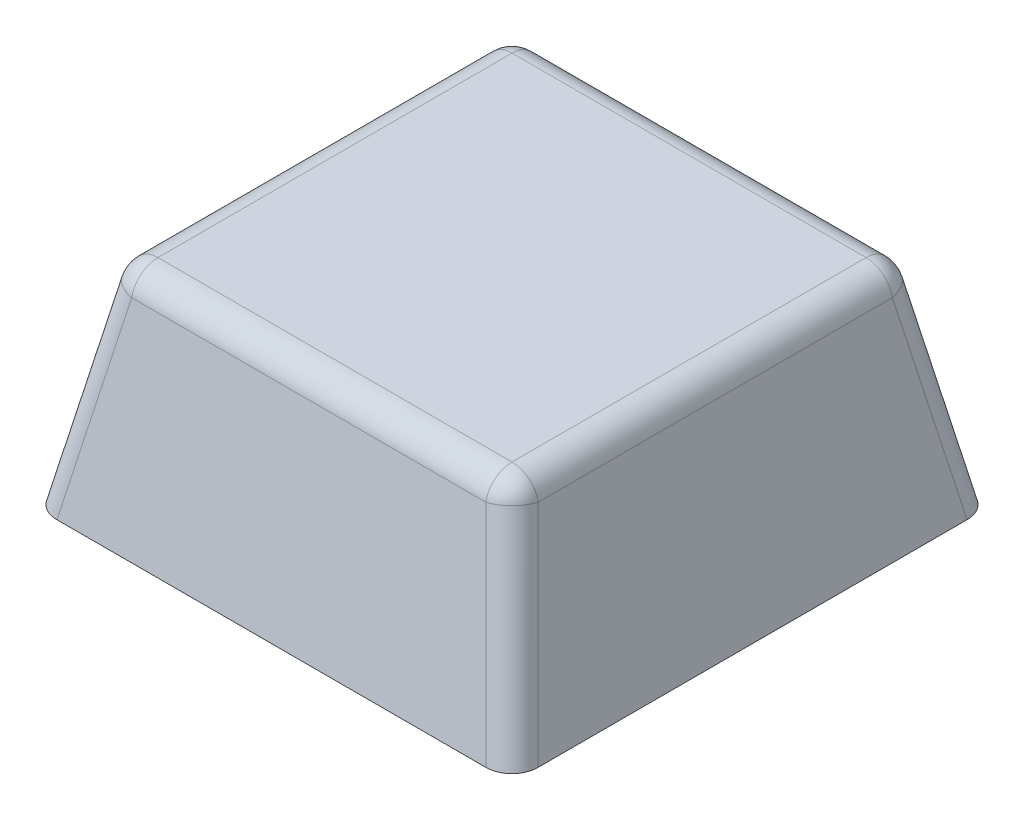
ISO-10303-21;
HEADER;
FILE_DESCRIPTION(('STEP AP214'),'2;1');
FILE_NAME('part.step','',(''),(''),'','','');
FILE_SCHEMA(('AUTOMOTIVE_DESIGN { 1 0 10303 214 1 1 1 1 }'));
ENDSEC;
DATA;
#1=APPLICATION_CONTEXT('core data for automotive mechanical design processes');
#2=APPLICATION_PROTOCOL_DEFINITION('international standard','automotive_design',2000,#1);
#3=PRODUCT_CONTEXT('',#1,'mechanical');
#4=PRODUCT('Part','Part','',(#3));
#5=PRODUCT_RELATED_PRODUCT_CATEGORY('part','',(#4));
#6=PRODUCT_DEFINITION_FORMATION('','',#4);
#7=PRODUCT_DEFINITION_CONTEXT('part definition',#1,'design');
#8=PRODUCT_DEFINITION('design','',#6,#7);
#9=PRODUCT_DEFINITION_SHAPE('','',#8);
#10=(LENGTH_UNIT() NAMED_UNIT(*) SI_UNIT(.MILLI.,.METRE.));
#11=(NAMED_UNIT(*) PLANE_ANGLE_UNIT() SI_UNIT($,.RADIAN.));
#12=(NAMED_UNIT(*) SI_UNIT($,.STERADIAN.) SOLID_ANGLE_UNIT());
#13=UNCERTAINTY_MEASURE_WITH_UNIT(LENGTH_MEASURE(1.E-05),#10,'distance_accuracy_value','');
#14=(GEOMETRIC_REPRESENTATION_CONTEXT(3) GLOBAL_UNCERTAINTY_ASSIGNED_CONTEXT((#13)) GLOBAL_UNIT_ASSIGNED_CONTEXT((#10,
#11,#12)) REPRESENTATION_CONTEXT('',''));
#15=CARTESIAN_POINT('',(0.,0.,0.));
#16=DIRECTION('',(0.,0.,1.));
#17=DIRECTION('',(1.,0.,0.));
#18=AXIS2_PLACEMENT_3D('',#15,#16,#17);
#19=CARTESIAN_POINT('',(0.,1.5,0.));
#20=DIRECTION('',(0.,-1.,0.));
#21=DIRECTION('',(0.,0.,-1.));
#22=AXIS2_PLACEMENT_3D('',#19,#20,#21);
#23=PLANE('',#22);
#24=CARTESIAN_POINT('',(0.,1.5,0.));
#25=DIRECTION('',(0.,-1.,0.));
#26=DIRECTION('',(0.,0.,-1.));
#27=AXIS2_PLACEMENT_3D('',#24,#25,#26);
#28=CIRCLE('',#27,2.8);
#29=CARTESIAN_POINT('',(0.,1.5,-2.8));
#30=VERTEX_POINT('',#29);
#31=EDGE_CURVE('E353',#30,#30,#28,.T.);
#32=ORIENTED_EDGE('',*,*,#31,.T.);
#33=EDGE_LOOP('',(#32));
#34=FACE_BOUND('',#33,.T.);
#35=DIRECTION('',(-1.,0.,0.));
#36=VECTOR('',#35,1.);
#37=CARTESIAN_POINT('',(0.,1.5,-0.580779620690919));
#38=LINE('',#37,#36);
#39=CARTESIAN_POINT('',(2.,1.5,-0.580779620690919));
#40=VERTEX_POINT('',#39);
#41=CARTESIAN_POINT('',(0.580779620690919,1.5,-0.580779620690919));
#42=VERTEX_POINT('',#41);
#43=EDGE_CURVE('E282',#40,#42,#38,.T.);
#44=ORIENTED_EDGE('',*,*,#43,.T.);
#45=DIRECTION('',(0.,0.,-1.));
#46=VECTOR('',#45,1.);
#47=CARTESIAN_POINT('',(0.580779620690918,1.5,0.));
#48=LINE('',#47,#46);
#49=CARTESIAN_POINT('',(0.580779620690919,1.5,-2.));
#50=VERTEX_POINT('',#49);
#51=EDGE_CURVE('E57',#42,#50,#48,.T.);
#52=ORIENTED_EDGE('',*,*,#51,.T.);
#53=DIRECTION('',(-1.,0.,0.));
#54=VECTOR('',#53,1.);
#55=CARTESIAN_POINT('',(0.,1.5,-2.));
#56=LINE('',#55,#54);
#57=CARTESIAN_POINT('',(-0.58077962069092,1.5,-2.));
#58=VERTEX_POINT('',#57);
#59=EDGE_CURVE('E240',#50,#58,#56,.T.);
#60=ORIENTED_EDGE('',*,*,#59,.T.);
#61=DIRECTION('',(0.,0.,-1.));
#62=VECTOR('',#61,1.);
#63=CARTESIAN_POINT('',(-0.58077962069092,1.5,0.));
#64=LINE('',#63,#62);
#65=CARTESIAN_POINT('',(-0.58077962069092,1.5,-0.580779620690919));
#66=VERTEX_POINT('',#65);
#67=EDGE_CURVE('E244',#66,#58,#64,.T.);
#68=ORIENTED_EDGE('',*,*,#67,.F.);
#69=DIRECTION('',(-1.,0.,0.));
#70=VECTOR('',#69,1.);
#71=CARTESIAN_POINT('',(0.,1.5,-0.580779620690919));
#72=LINE('',#71,#70);
#73=CARTESIAN_POINT('',(-2.,1.5,-0.580779620690919));
#74=VERTEX_POINT('',#73);
#75=EDGE_CURVE('E313',#66,#74,#72,.T.);
#76=ORIENTED_EDGE('',*,*,#75,.T.);
#77=DIRECTION('',(0.,0.,-1.));
#78=VECTOR('',#77,1.);
#79=CARTESIAN_POINT('',(-2.,1.5,0.));
#80=LINE('',#79,#78);
#81=CARTESIAN_POINT('',(-2.,1.5,0.580779620690919));
#82=VERTEX_POINT('',#81);
#83=EDGE_CURVE('E309',#82,#74,#80,.T.);
#84=ORIENTED_EDGE('',*,*,#83,.F.);
#85=DIRECTION('',(-1.,0.,0.));
#86=VECTOR('',#85,1.);
#87=CARTESIAN_POINT('',(0.,1.5,0.580779620690919));
#88=LINE('',#87,#86);
#89=CARTESIAN_POINT('',(-0.58077962069092,1.5,0.580779620690919));
#90=VERTEX_POINT('',#89);
#91=EDGE_CURVE('E305',#90,#82,#88,.T.);
#92=ORIENTED_EDGE('',*,*,#91,.F.);
#93=DIRECTION('',(0.,0.,-1.));
#94=VECTOR('',#93,1.);
#95=CARTESIAN_POINT('',(-0.58077962069092,1.5,0.));
#96=LINE('',#95,#94);
#97=CARTESIAN_POINT('',(-0.58077962069092,1.5,2.));
#98=VERTEX_POINT('',#97);
#99=EDGE_CURVE('E301',#98,#90,#96,.T.);
#100=ORIENTED_EDGE('',*,*,#99,.F.);
#101=DIRECTION('',(-1.,0.,0.));
#102=VECTOR('',#101,1.);
#103=CARTESIAN_POINT('',(0.,1.5,2.));
#104=LINE('',#103,#102);
#105=CARTESIAN_POINT('',(0.580779620690918,1.5,2.));
#106=VERTEX_POINT('',#105);
#107=EDGE_CURVE('E297',#106,#98,#104,.T.);
#108=ORIENTED_EDGE('',*,*,#107,.F.);
#109=DIRECTION('',(0.,0.,-1.));
#110=VECTOR('',#109,1.);
#111=CARTESIAN_POINT('',(0.580779620690918,1.5,0.));
#112=LINE('',#111,#110);
#113=CARTESIAN_POINT('',(0.580779620690919,1.5,0.580779620690919));
#114=VERTEX_POINT('',#113);
#115=EDGE_CURVE('E293',#106,#114,#112,.T.);
#116=ORIENTED_EDGE('',*,*,#115,.T.);
#117=DIRECTION('',(-1.,0.,0.));
#118=VECTOR('',#117,1.);
#119=CARTESIAN_POINT('',(0.,1.5,0.580779620690919));
#120=LINE('',#119,#118);
#121=CARTESIAN_POINT('',(2.,1.5,0.580779620690919));
#122=VERTEX_POINT('',#121);
#123=EDGE_CURVE('E289',#122,#114,#120,.T.);
#124=ORIENTED_EDGE('',*,*,#123,.F.);
#125=DIRECTION('',(0.,0.,-1.));
#126=VECTOR('',#125,1.);
#127=CARTESIAN_POINT('',(2.,1.5,0.));
#128=LINE('',#127,#126);
#129=EDGE_CURVE('E285',#122,#40,#128,.T.);
#130=ORIENTED_EDGE('',*,*,#129,.T.);
#131=EDGE_LOOP('',(#44,#52,#60,#68,#76,#84,#92,#100,#108,#116,#124,#130));
#132=FACE_BOUND('',#131,.T.);
#133=ADVANCED_FACE('F39',(#34,#132),#23,.T.);
#134=CARTESIAN_POINT('',(0.,0.,0.));
#135=DIRECTION('',(0.,-1.,0.));
#136=DIRECTION('',(0.,0.,-1.));
#137=AXIS2_PLACEMENT_3D('',#134,#135,#136);
#138=PLANE('',#137);
#139=DIRECTION('',(-1.,0.,0.));
#140=VECTOR('',#139,1.);
#141=CARTESIAN_POINT('',(-9.,0.,-9.));
#142=LINE('',#141,#140);
#143=CARTESIAN_POINT('',(8.01837281655234,0.,-9.));
#144=VERTEX_POINT('',#143);
#145=CARTESIAN_POINT('',(-8.01837281655234,0.,-9.));
#146=VERTEX_POINT('',#145);
#147=EDGE_CURVE('E407',#144,#146,#142,.T.);
#148=ORIENTED_EDGE('',*,*,#147,.F.);
#149=CARTESIAN_POINT('',(7.98128330504479,0.,-7.98128330504479));
#150=DIRECTION('',(0.,-1.,0.));
#151=DIRECTION('',(0.707106781186548,0.,-0.707106781186548));
#152=AXIS2_PLACEMENT_3D('',#149,#150,#151);
#153=ELLIPSE('',#152,1.03709566056413,1.);
#154=CARTESIAN_POINT('',(9.,0.,-8.01837281655234));
#155=VERTEX_POINT('',#154);
#156=EDGE_CURVE('E438',#144,#155,#153,.T.);
#157=ORIENTED_EDGE('',*,*,#156,.T.);
#158=DIRECTION('',(0.,0.,-1.));
#159=VECTOR('',#158,1.);
#160=CARTESIAN_POINT('',(9.,0.,9.));
#161=LINE('',#160,#159);
#162=CARTESIAN_POINT('',(9.,0.,8.01837281655234));
#163=VERTEX_POINT('',#162);
#164=EDGE_CURVE('E403',#163,#155,#161,.T.);
#165=ORIENTED_EDGE('',*,*,#164,.F.);
#166=CARTESIAN_POINT('',(7.98128330504479,0.,7.98128330504479));
#167=DIRECTION('',(0.,-1.,0.));
#168=DIRECTION('',(0.707106781186548,0.,0.707106781186548));
#169=AXIS2_PLACEMENT_3D('',#166,#167,#168);
#170=ELLIPSE('',#169,1.03709566056413,1.);
#171=CARTESIAN_POINT('',(8.01837281655234,0.,9.));
#172=VERTEX_POINT('',#171);
#173=EDGE_CURVE('E429',#163,#172,#170,.T.);
#174=ORIENTED_EDGE('',*,*,#173,.T.);
#175=DIRECTION('',(1.,0.,0.));
#176=VECTOR('',#175,1.);
#177=CARTESIAN_POINT('',(-9.,0.,9.));
#178=LINE('',#177,#176);
#179=CARTESIAN_POINT('',(-8.01837281655234,0.,9.));
#180=VERTEX_POINT('',#179);
#181=EDGE_CURVE('E415',#180,#172,#178,.T.);
#182=ORIENTED_EDGE('',*,*,#181,.F.);
#183=CARTESIAN_POINT('',(-7.98128330504479,0.,7.98128330504479));
#184=DIRECTION('',(0.,-1.,0.));
#185=DIRECTION('',(-0.707106781186548,0.,0.707106781186548));
#186=AXIS2_PLACEMENT_3D('',#183,#184,#185);
#187=ELLIPSE('',#186,1.03709566056413,1.);
#188=CARTESIAN_POINT('',(-9.,0.,8.01837281655234));
#189=VERTEX_POINT('',#188);
#190=EDGE_CURVE('E432',#180,#189,#187,.T.);
#191=ORIENTED_EDGE('',*,*,#190,.T.);
#192=DIRECTION('',(0.,0.,1.));
#193=VECTOR('',#192,1.);
#194=CARTESIAN_POINT('',(-9.,0.,9.));
#195=LINE('',#194,#193);
#196=CARTESIAN_POINT('',(-9.,0.,-8.01837281655234));
#197=VERTEX_POINT('',#196);
#198=EDGE_CURVE('E411',#197,#189,#195,.T.);
#199=ORIENTED_EDGE('',*,*,#198,.F.);
#200=CARTESIAN_POINT('',(-7.98128330504479,0.,-7.98128330504479));
#201=DIRECTION('',(0.,-1.,0.));
#202=DIRECTION('',(-0.707106781186548,0.,-0.707106781186548));
#203=AXIS2_PLACEMENT_3D('',#200,#201,#202);
#204=ELLIPSE('',#203,1.03709566056413,1.);
#205=EDGE_CURVE('E435',#197,#146,#204,.T.);
#206=ORIENTED_EDGE('',*,*,#205,.T.);
#207=EDGE_LOOP('',(#148,#157,#165,#174,#182,#191,#199,#206));
#208=FACE_BOUND('',#207,.T.);
#209=DIRECTION('',(0.,0.,1.));
#210=VECTOR('',#209,1.);
#211=CARTESIAN_POINT('',(7.98128330504478,0.,0.));
#212=LINE('',#211,#210);
#213=CARTESIAN_POINT('',(7.98128330504479,0.,7.98128330504479));
#214=VERTEX_POINT('',#213);
#215=CARTESIAN_POINT('',(7.98128330504479,0.,-7.98128330504479));
#216=VERTEX_POINT('',#215);
#217=EDGE_CURVE('E357',#214,#216,#212,.F.);
#218=ORIENTED_EDGE('',*,*,#217,.T.);
#219=DIRECTION('',(1.,0.,0.));
#220=VECTOR('',#219,1.);
#221=CARTESIAN_POINT('',(0.,0.,-7.98128330504478));
#222=LINE('',#221,#220);
#223=CARTESIAN_POINT('',(-7.98128330504479,0.,-7.98128330504479));
#224=VERTEX_POINT('',#223);
#225=EDGE_CURVE('E393',#216,#224,#222,.F.);
#226=ORIENTED_EDGE('',*,*,#225,.T.);
#227=DIRECTION('',(0.,0.,-1.));
#228=VECTOR('',#227,1.);
#229=CARTESIAN_POINT('',(-7.98128330504478,0.,0.));
#230=LINE('',#229,#228);
#231=CARTESIAN_POINT('',(-7.98128330504479,0.,7.98128330504479));
#232=VERTEX_POINT('',#231);
#233=EDGE_CURVE('E396',#224,#232,#230,.F.);
#234=ORIENTED_EDGE('',*,*,#233,.T.);
#235=DIRECTION('',(-1.,0.,0.));
#236=VECTOR('',#235,1.);
#237=CARTESIAN_POINT('',(0.,0.,7.98128330504478));
#238=LINE('',#237,#236);
#239=EDGE_CURVE('E65',#232,#214,#238,.F.);
#240=ORIENTED_EDGE('',*,*,#239,.T.);
#241=EDGE_LOOP('',(#218,#226,#234,#240));
#242=FACE_BOUND('',#241,.T.);
#243=ADVANCED_FACE('F537',(#208,#242),#138,.T.);
#244=CARTESIAN_POINT('',(9.,0.,9.));
#245=DIRECTION('',(0.981627183447664,0.190808995376545,0.));
#246=DIRECTION('',(-0.190808995376545,0.981627183447664,0.));
#247=AXIS2_PLACEMENT_3D('',#244,#245,#246);
#248=PLANE('',#247);
#249=ORIENTED_EDGE('',*,*,#164,.T.);
#250=DIRECTION('',(-0.187427559991896,0.964231206459825,0.187427559991896));
#251=VECTOR('',#250,1.);
#252=CARTESIAN_POINT('',(8.40216004551252,3.07561993876608,-7.42053286206486));
#253=LINE('',#252,#251);
#254=CARTESIAN_POINT('',(7.60224832452842,7.19080899537655,-6.62062114108076));
#255=VERTEX_POINT('',#254);
#256=EDGE_CURVE('E447',#155,#255,#253,.T.);
#257=ORIENTED_EDGE('',*,*,#256,.T.);
#258=DIRECTION('',(0.,0.,-1.));
#259=VECTOR('',#258,1.);
#260=CARTESIAN_POINT('',(7.60224832452842,7.19080899537655,9.));
#261=LINE('',#260,#259);
#262=CARTESIAN_POINT('',(7.60224832452842,7.19080899537655,6.62062114108076));
#263=VERTEX_POINT('',#262);
#264=EDGE_CURVE('E441',#255,#263,#261,.F.);
#265=ORIENTED_EDGE('',*,*,#264,.T.);
#266=DIRECTION('',(-0.187427559991896,0.964231206459825,-0.187427559991896));
#267=VECTOR('',#266,1.);
#268=CARTESIAN_POINT('',(9.0344836699138,-0.177403102540449,8.05285648646614));
#269=LINE('',#268,#267);
#270=EDGE_CURVE('E444',#263,#163,#269,.F.);
#271=ORIENTED_EDGE('',*,*,#270,.T.);
#272=EDGE_LOOP('',(#249,#257,#265,#271));
#273=FACE_BOUND('',#272,.T.);
#274=ADVANCED_FACE('F586',(#273),#248,.T.);
#275=CARTESIAN_POINT('',(-9.,0.,-9.));
#276=DIRECTION('',(0.,0.190808995376545,-0.981627183447664));
#277=DIRECTION('',(0.,0.981627183447664,0.190808995376545));
#278=AXIS2_PLACEMENT_3D('',#275,#276,#277);
#279=PLANE('',#278);
#280=DIRECTION('',(-1.,0.,0.));
#281=VECTOR('',#280,1.);
#282=CARTESIAN_POINT('',(-9.,7.19080899537655,-7.60224832452842));
#283=LINE('',#282,#281);
#284=CARTESIAN_POINT('',(-6.62062114108076,7.19080899537655,-7.60224832452842));
#285=VERTEX_POINT('',#284);
#286=CARTESIAN_POINT('',(6.62062114108076,7.19080899537655,-7.60224832452842));
#287=VERTEX_POINT('',#286);
#288=EDGE_CURVE('E419',#285,#287,#283,.F.);
#289=ORIENTED_EDGE('',*,*,#288,.T.);
#290=DIRECTION('',(-0.187427559991896,0.964231206459825,0.187427559991896));
#291=VECTOR('',#290,1.);
#292=CARTESIAN_POINT('',(7.42053286206486,3.07561993876608,-8.40216004551252));
#293=LINE('',#292,#291);
#294=EDGE_CURVE('E425',#287,#144,#293,.F.);
#295=ORIENTED_EDGE('',*,*,#294,.T.);
#296=ORIENTED_EDGE('',*,*,#147,.T.);
#297=DIRECTION('',(0.187427559991896,0.964231206459825,0.187427559991896));
#298=VECTOR('',#297,1.);
#299=CARTESIAN_POINT('',(-8.05285648646614,-0.177403102540449,-9.0344836699138));
#300=LINE('',#299,#298);
#301=EDGE_CURVE('E422',#146,#285,#300,.T.);
#302=ORIENTED_EDGE('',*,*,#301,.T.);
#303=EDGE_LOOP('',(#289,#295,#296,#302));
#304=FACE_BOUND('',#303,.T.);
#305=ADVANCED_FACE('F580',(#304),#279,.T.);
#306=CARTESIAN_POINT('',(-9.,0.,9.));
#307=DIRECTION('',(-0.981627183447664,0.190808995376545,0.));
#308=DIRECTION('',(-0.190808995376545,-0.981627183447664,0.));
#309=AXIS2_PLACEMENT_3D('',#306,#307,#308);
#310=PLANE('',#309);
#311=DIRECTION('',(0.,0.,1.));
#312=VECTOR('',#311,1.);
#313=CARTESIAN_POINT('',(-7.60224832452842,7.19080899537655,9.));
#314=LINE('',#313,#312);
#315=CARTESIAN_POINT('',(-7.60224832452842,7.19080899537655,6.62062114108076));
#316=VERTEX_POINT('',#315);
#317=CARTESIAN_POINT('',(-7.60224832452842,7.19080899537655,-6.62062114108076));
#318=VERTEX_POINT('',#317);
#319=EDGE_CURVE('E450',#316,#318,#314,.F.);
#320=ORIENTED_EDGE('',*,*,#319,.T.);
#321=DIRECTION('',(0.187427559991896,0.964231206459825,0.187427559991896));
#322=VECTOR('',#321,1.);
#323=CARTESIAN_POINT('',(-8.40216004551252,3.07561993876608,-7.42053286206486));
#324=LINE('',#323,#322);
#325=EDGE_CURVE('E456',#318,#197,#324,.F.);
#326=ORIENTED_EDGE('',*,*,#325,.T.);
#327=ORIENTED_EDGE('',*,*,#198,.T.);
#328=DIRECTION('',(0.187427559991896,0.964231206459825,-0.187427559991896));
#329=VECTOR('',#328,1.);
#330=CARTESIAN_POINT('',(-9.0344836699138,-0.177403102540449,8.05285648646614));
#331=LINE('',#330,#329);
#332=EDGE_CURVE('E453',#189,#316,#331,.T.);
#333=ORIENTED_EDGE('',*,*,#332,.T.);
#334=EDGE_LOOP('',(#320,#326,#327,#333));
#335=FACE_BOUND('',#334,.T.);
#336=ADVANCED_FACE('F574',(#335),#310,.T.);
#337=CARTESIAN_POINT('',(-9.,0.,9.));
#338=DIRECTION('',(0.,0.190808995376545,0.981627183447664));
#339=DIRECTION('',(0.,-0.981627183447664,0.190808995376545));
#340=AXIS2_PLACEMENT_3D('',#337,#338,#339);
#341=PLANE('',#340);
#342=DIRECTION('',(1.,0.,0.));
#343=VECTOR('',#342,1.);
#344=CARTESIAN_POINT('',(-9.,7.19080899537655,7.60224832452842));
#345=LINE('',#344,#343);
#346=CARTESIAN_POINT('',(6.62062114108076,7.19080899537655,7.60224832452842));
#347=VERTEX_POINT('',#346);
#348=CARTESIAN_POINT('',(-6.62062114108076,7.19080899537655,7.60224832452842));
#349=VERTEX_POINT('',#348);
#350=EDGE_CURVE('E459',#347,#349,#345,.F.);
#351=ORIENTED_EDGE('',*,*,#350,.T.);
#352=DIRECTION('',(0.187427559991896,0.964231206459825,-0.187427559991896));
#353=VECTOR('',#352,1.);
#354=CARTESIAN_POINT('',(-8.05285648646614,-0.177403102540449,9.0344836699138));
#355=LINE('',#354,#353);
#356=EDGE_CURVE('E465',#349,#180,#355,.F.);
#357=ORIENTED_EDGE('',*,*,#356,.T.);
#358=ORIENTED_EDGE('',*,*,#181,.T.);
#359=DIRECTION('',(-0.187427559991896,0.964231206459825,-0.187427559991896));
#360=VECTOR('',#359,1.);
#361=CARTESIAN_POINT('',(7.42053286206486,3.07561993876608,8.40216004551252));
#362=LINE('',#361,#360);
#363=EDGE_CURVE('E462',#172,#347,#362,.T.);
#364=ORIENTED_EDGE('',*,*,#363,.T.);
#365=EDGE_LOOP('',(#351,#357,#358,#364));
#366=FACE_BOUND('',#365,.T.);
#367=ADVANCED_FACE('F533',(#366),#341,.T.);
#368=CARTESIAN_POINT('',(0.,8.,0.));
#369=DIRECTION('',(0.,-1.,0.));
#370=DIRECTION('',(0.,0.,-1.));
#371=AXIS2_PLACEMENT_3D('',#368,#369,#370);
#372=PLANE('',#371);
#373=DIRECTION('',(0.,0.,1.));
#374=VECTOR('',#373,1.);
#375=CARTESIAN_POINT('',(6.62062114108075,8.,0.));
#376=LINE('',#375,#374);
#377=CARTESIAN_POINT('',(6.62062114108075,8.,6.62062114108075));
#378=VERTEX_POINT('',#377);
#379=CARTESIAN_POINT('',(6.62062114108075,8.,-6.62062114108075));
#380=VERTEX_POINT('',#379);
#381=EDGE_CURVE('E468',#378,#380,#376,.F.);
#382=ORIENTED_EDGE('',*,*,#381,.T.);
#383=DIRECTION('',(1.,0.,0.));
#384=VECTOR('',#383,1.);
#385=CARTESIAN_POINT('',(0.,8.,-6.62062114108075));
#386=LINE('',#385,#384);
#387=CARTESIAN_POINT('',(-6.62062114108075,8.,-6.62062114108075));
#388=VERTEX_POINT('',#387);
#389=EDGE_CURVE('E11',#380,#388,#386,.F.);
#390=ORIENTED_EDGE('',*,*,#389,.T.);
#391=DIRECTION('',(0.,0.,-1.));
#392=VECTOR('',#391,1.);
#393=CARTESIAN_POINT('',(-6.62062114108075,8.,0.));
#394=LINE('',#393,#392);
#395=CARTESIAN_POINT('',(-6.62062114108075,8.,6.62062114108075));
#396=VERTEX_POINT('',#395);
#397=EDGE_CURVE('E49',#388,#396,#394,.F.);
#398=ORIENTED_EDGE('',*,*,#397,.T.);
#399=DIRECTION('',(-1.,0.,0.));
#400=VECTOR('',#399,1.);
#401=CARTESIAN_POINT('',(0.,8.,6.62062114108075));
#402=LINE('',#401,#400);
#403=EDGE_CURVE('E471',#396,#378,#402,.F.);
#404=ORIENTED_EDGE('',*,*,#403,.T.);
#405=EDGE_LOOP('',(#382,#390,#398,#404));
#406=FACE_BOUND('',#405,.T.);
#407=ADVANCED_FACE('F558',(#406),#372,.F.);
#408=CARTESIAN_POINT('',(-8.05285648646614,-0.368212097916994,8.05285648646614));
#409=DIRECTION('',(-0.187427559991896,-0.964231206459825,0.187427559991896));
#410=DIRECTION('',(0.,-0.190808995376545,-0.981627183447664));
#411=AXIS2_PLACEMENT_3D('',#408,#409,#410);
#412=CYLINDRICAL_SURFACE('',#411,1.);
#413=CARTESIAN_POINT('',(-6.62062114108076,7.,6.62062114108076));
#414=DIRECTION('',(0.187427559991896,0.964231206459824,-0.187427559991896));
#415=DIRECTION('',(-0.981627183447664,0.190808995376545,0.));
#416=AXIS2_PLACEMENT_3D('',#413,#414,#415);
#417=CIRCLE('',#416,1.);
#418=EDGE_CURVE('E43',#316,#349,#417,.T.);
#419=ORIENTED_EDGE('',*,*,#418,.F.);
#420=ORIENTED_EDGE('',*,*,#332,.F.);
#421=ORIENTED_EDGE('',*,*,#190,.F.);
#422=ORIENTED_EDGE('',*,*,#356,.F.);
#423=EDGE_LOOP('',(#419,#420,#421,#422));
#424=FACE_BOUND('',#423,.T.);
#425=ADVANCED_FACE('F41',(#424),#412,.T.);
#426=CARTESIAN_POINT('',(-6.62062114108076,7.,6.62062114108076));
#427=DIRECTION('',(0.,0.,1.));
#428=DIRECTION('',(1.,0.,0.));
#429=AXIS2_PLACEMENT_3D('',#426,#427,#428);
#430=SPHERICAL_SURFACE('',#429,1.);
#431=CARTESIAN_POINT('',(-6.62062114108075,7.,6.62062114108075));
#432=DIRECTION('',(0.,0.,1.));
#433=DIRECTION('',(1.,0.,0.));
#434=AXIS2_PLACEMENT_3D('',#431,#432,#433);
#435=CIRCLE('',#434,1.);
#436=EDGE_CURVE('E510',#316,#396,#435,.F.);
#437=ORIENTED_EDGE('',*,*,#436,.F.);
#438=ORIENTED_EDGE('',*,*,#418,.T.);
#439=CARTESIAN_POINT('',(-6.62062114108076,7.,6.62062114108076));
#440=DIRECTION('',(-1.,0.,0.));
#441=DIRECTION('',(0.,-1.,0.));
#442=AXIS2_PLACEMENT_3D('',#439,#440,#441);
#443=CIRCLE('',#442,1.);
#444=EDGE_CURVE('E513',#396,#349,#443,.F.);
#445=ORIENTED_EDGE('',*,*,#444,.F.);
#446=EDGE_LOOP('',(#437,#438,#445));
#447=FACE_BOUND('',#446,.T.);
#448=ADVANCED_FACE('F525',(#447),#430,.T.);
#449=CARTESIAN_POINT('',(8.05285648646614,-0.368212097916994,8.05285648646614));
#450=DIRECTION('',(0.187427559991896,-0.964231206459825,0.187427559991896));
#451=DIRECTION('',(0.,-0.190808995376545,-0.981627183447664));
#452=AXIS2_PLACEMENT_3D('',#449,#450,#451);
#453=CYLINDRICAL_SURFACE('',#452,1.);
#454=ORIENTED_EDGE('',*,*,#173,.F.);
#455=ORIENTED_EDGE('',*,*,#270,.F.);
#456=CARTESIAN_POINT('',(6.62062114108076,7.,6.62062114108076));
#457=DIRECTION('',(-0.187427559991896,0.964231206459824,-0.187427559991896));
#458=DIRECTION('',(0.,0.190808995376545,0.981627183447664));
#459=AXIS2_PLACEMENT_3D('',#456,#457,#458);
#460=CIRCLE('',#459,1.);
#461=EDGE_CURVE('E506',#347,#263,#460,.T.);
#462=ORIENTED_EDGE('',*,*,#461,.F.);
#463=ORIENTED_EDGE('',*,*,#363,.F.);
#464=EDGE_LOOP('',(#454,#455,#462,#463));
#465=FACE_BOUND('',#464,.T.);
#466=ADVANCED_FACE('F544',(#465),#453,.T.);
#467=CARTESIAN_POINT('',(0.,7.,6.62062114108075));
#468=DIRECTION('',(-1.,0.,0.));
#469=DIRECTION('',(0.,0.,1.));
#470=AXIS2_PLACEMENT_3D('',#467,#468,#469);
#471=CYLINDRICAL_SURFACE('',#470,1.);
#472=ORIENTED_EDGE('',*,*,#444,.T.);
#473=ORIENTED_EDGE('',*,*,#350,.F.);
#474=CARTESIAN_POINT('',(6.62062114108075,7.,6.62062114108075));
#475=DIRECTION('',(1.,0.,0.));
#476=DIRECTION('',(0.,0.,-1.));
#477=AXIS2_PLACEMENT_3D('',#474,#475,#476);
#478=CIRCLE('',#477,1.);
#479=EDGE_CURVE('E502',#378,#347,#478,.T.);
#480=ORIENTED_EDGE('',*,*,#479,.F.);
#481=ORIENTED_EDGE('',*,*,#403,.F.);
#482=EDGE_LOOP('',(#472,#473,#480,#481));
#483=FACE_BOUND('',#482,.T.);
#484=ADVANCED_FACE('F547',(#483),#471,.T.);
#485=CARTESIAN_POINT('',(-6.62062114108075,7.,0.));
#486=DIRECTION('',(0.,0.,-1.));
#487=DIRECTION('',(-1.,0.,0.));
#488=AXIS2_PLACEMENT_3D('',#485,#486,#487);
#489=CYLINDRICAL_SURFACE('',#488,1.);
#490=ORIENTED_EDGE('',*,*,#436,.T.);
#491=ORIENTED_EDGE('',*,*,#397,.F.);
#492=CARTESIAN_POINT('',(-6.62062114108076,7.,-6.62062114108076));
#493=DIRECTION('',(0.,0.,-1.));
#494=DIRECTION('',(0.,1.,0.));
#495=AXIS2_PLACEMENT_3D('',#492,#493,#494);
#496=CIRCLE('',#495,1.);
#497=EDGE_CURVE('E498',#318,#388,#496,.T.);
#498=ORIENTED_EDGE('',*,*,#497,.F.);
#499=ORIENTED_EDGE('',*,*,#319,.F.);
#500=EDGE_LOOP('',(#490,#491,#498,#499));
#501=FACE_BOUND('',#500,.T.);
#502=ADVANCED_FACE('F571',(#501),#489,.T.);
#503=CARTESIAN_POINT('',(-7.42053286206485,2.88481094338953,-7.42053286206486));
#504=DIRECTION('',(-0.187427559991896,-0.964231206459825,-0.187427559991896));
#505=DIRECTION('',(0.,0.190808995376545,-0.981627183447664));
#506=AXIS2_PLACEMENT_3D('',#503,#504,#505);
#507=CYLINDRICAL_SURFACE('',#506,1.);
#508=ORIENTED_EDGE('',*,*,#205,.F.);
#509=ORIENTED_EDGE('',*,*,#325,.F.);
#510=CARTESIAN_POINT('',(-6.62062114108076,7.,-6.62062114108076));
#511=DIRECTION('',(0.187427559991896,0.964231206459824,0.187427559991896));
#512=DIRECTION('',(0.,-0.190808995376545,0.981627183447664));
#513=AXIS2_PLACEMENT_3D('',#510,#511,#512);
#514=CIRCLE('',#513,1.);
#515=EDGE_CURVE('E494',#285,#318,#514,.T.);
#516=ORIENTED_EDGE('',*,*,#515,.F.);
#517=ORIENTED_EDGE('',*,*,#301,.F.);
#518=EDGE_LOOP('',(#508,#509,#516,#517));
#519=FACE_BOUND('',#518,.T.);
#520=ADVANCED_FACE('F577',(#519),#507,.T.);
#521=CARTESIAN_POINT('',(6.62062114108076,7.,6.62062114108076));
#522=DIRECTION('',(0.,0.,1.));
#523=DIRECTION('',(1.,0.,0.));
#524=AXIS2_PLACEMENT_3D('',#521,#522,#523);
#525=SPHERICAL_SURFACE('',#524,1.);
#526=ORIENTED_EDGE('',*,*,#479,.T.);
#527=ORIENTED_EDGE('',*,*,#461,.T.);
#528=CARTESIAN_POINT('',(6.62062114108076,7.,6.62062114108076));
#529=DIRECTION('',(0.,0.,1.));
#530=DIRECTION('',(0.,-1.,0.));
#531=AXIS2_PLACEMENT_3D('',#528,#529,#530);
#532=CIRCLE('',#531,1.);
#533=EDGE_CURVE('E490',#378,#263,#532,.F.);
#534=ORIENTED_EDGE('',*,*,#533,.F.);
#535=EDGE_LOOP('',(#526,#527,#534));
#536=FACE_BOUND('',#535,.T.);
#537=ADVANCED_FACE('F551',(#536),#525,.T.);
#538=CARTESIAN_POINT('',(-6.62062114108076,7.,-6.62062114108076));
#539=DIRECTION('',(0.,0.,1.));
#540=DIRECTION('',(1.,0.,0.));
#541=AXIS2_PLACEMENT_3D('',#538,#539,#540);
#542=SPHERICAL_SURFACE('',#541,1.);
#543=ORIENTED_EDGE('',*,*,#515,.T.);
#544=ORIENTED_EDGE('',*,*,#497,.T.);
#545=CARTESIAN_POINT('',(-6.62062114108075,7.,-6.62062114108075));
#546=DIRECTION('',(-1.,0.,0.));
#547=DIRECTION('',(0.,0.,1.));
#548=AXIS2_PLACEMENT_3D('',#545,#546,#547);
#549=CIRCLE('',#548,1.);
#550=EDGE_CURVE('E487',#285,#388,#549,.F.);
#551=ORIENTED_EDGE('',*,*,#550,.F.);
#552=EDGE_LOOP('',(#543,#544,#551));
#553=FACE_BOUND('',#552,.T.);
#554=ADVANCED_FACE('F568',(#553),#542,.T.);
#555=CARTESIAN_POINT('',(6.62062114108075,7.,0.));
#556=DIRECTION('',(0.,0.,1.));
#557=DIRECTION('',(1.,0.,0.));
#558=AXIS2_PLACEMENT_3D('',#555,#556,#557);
#559=CYLINDRICAL_SURFACE('',#558,1.);
#560=ORIENTED_EDGE('',*,*,#533,.T.);
#561=ORIENTED_EDGE('',*,*,#264,.F.);
#562=CARTESIAN_POINT('',(6.62062114108075,7.,-6.62062114108075));
#563=DIRECTION('',(0.,0.,-1.));
#564=DIRECTION('',(-1.,0.,0.));
#565=AXIS2_PLACEMENT_3D('',#562,#563,#564);
#566=CIRCLE('',#565,1.);
#567=EDGE_CURVE('E483',#380,#255,#566,.T.);
#568=ORIENTED_EDGE('',*,*,#567,.F.);
#569=ORIENTED_EDGE('',*,*,#381,.F.);
#570=EDGE_LOOP('',(#560,#561,#568,#569));
#571=FACE_BOUND('',#570,.T.);
#572=ADVANCED_FACE('F555',(#571),#559,.T.);
#573=CARTESIAN_POINT('',(0.,7.,-6.62062114108075));
#574=DIRECTION('',(1.,0.,0.));
#575=DIRECTION('',(0.,0.,-1.));
#576=AXIS2_PLACEMENT_3D('',#573,#574,#575);
#577=CYLINDRICAL_SURFACE('',#576,1.);
#578=ORIENTED_EDGE('',*,*,#550,.T.);
#579=ORIENTED_EDGE('',*,*,#389,.F.);
#580=CARTESIAN_POINT('',(6.62062114108076,7.,-6.62062114108076));
#581=DIRECTION('',(1.,0.,0.));
#582=DIRECTION('',(0.,1.,0.));
#583=AXIS2_PLACEMENT_3D('',#580,#581,#582);
#584=CIRCLE('',#583,1.);
#585=EDGE_CURVE('E479',#287,#380,#584,.T.);
#586=ORIENTED_EDGE('',*,*,#585,.F.);
#587=ORIENTED_EDGE('',*,*,#288,.F.);
#588=EDGE_LOOP('',(#578,#579,#586,#587));
#589=FACE_BOUND('',#588,.T.);
#590=ADVANCED_FACE('F561',(#589),#577,.T.);
#591=CARTESIAN_POINT('',(6.62062114108076,7.,-6.62062114108076));
#592=DIRECTION('',(0.,0.,1.));
#593=DIRECTION('',(1.,0.,0.));
#594=AXIS2_PLACEMENT_3D('',#591,#592,#593);
#595=SPHERICAL_SURFACE('',#594,1.);
#596=ORIENTED_EDGE('',*,*,#585,.T.);
#597=ORIENTED_EDGE('',*,*,#567,.T.);
#598=CARTESIAN_POINT('',(6.62062114108076,7.,-6.62062114108076));
#599=DIRECTION('',(-0.187427559991896,0.964231206459824,0.187427559991896));
#600=DIRECTION('',(0.,-0.190808995376545,0.981627183447664));
#601=AXIS2_PLACEMENT_3D('',#598,#599,#600);
#602=CIRCLE('',#601,1.);
#603=EDGE_CURVE('E377',#287,#255,#602,.F.);
#604=ORIENTED_EDGE('',*,*,#603,.F.);
#605=EDGE_LOOP('',(#596,#597,#604));
#606=FACE_BOUND('',#605,.T.);
#607=ADVANCED_FACE('F588',(#606),#595,.T.);
#608=CARTESIAN_POINT('',(7.42053286206486,2.88481094338953,-7.42053286206485));
#609=DIRECTION('',(0.187427559991896,-0.964231206459825,-0.187427559991896));
#610=DIRECTION('',(0.,0.190808995376545,-0.981627183447664));
#611=AXIS2_PLACEMENT_3D('',#608,#609,#610);
#612=CYLINDRICAL_SURFACE('',#611,1.);
#613=ORIENTED_EDGE('',*,*,#603,.T.);
#614=ORIENTED_EDGE('',*,*,#256,.F.);
#615=ORIENTED_EDGE('',*,*,#156,.F.);
#616=ORIENTED_EDGE('',*,*,#294,.F.);
#617=EDGE_LOOP('',(#613,#614,#615,#616));
#618=FACE_BOUND('',#617,.T.);
#619=ADVANCED_FACE('F583',(#618),#612,.T.);
#620=CARTESIAN_POINT('',(8.01837281655234,-0.190808995376545,9.));
#621=DIRECTION('',(0.981627183447664,0.190808995376545,0.));
#622=DIRECTION('',(-0.190808995376545,0.981627183447664,0.));
#623=AXIS2_PLACEMENT_3D('',#620,#621,#622);
#624=PLANE('',#623);
#625=ORIENTED_EDGE('',*,*,#217,.F.);
#626=DIRECTION('',(0.187427559991896,-0.964231206459825,0.187427559991896));
#627=VECTOR('',#626,1.);
#628=CARTESIAN_POINT('',(8.05285648646614,-0.368212097916994,8.05285648646614));
#629=LINE('',#628,#627);
#630=CARTESIAN_POINT('',(6.62062114108076,7.,6.62062114108076));
#631=VERTEX_POINT('',#630);
#632=EDGE_CURVE('E366',#631,#214,#629,.T.);
#633=ORIENTED_EDGE('',*,*,#632,.F.);
#634=DIRECTION('',(0.,0.,-1.));
#635=VECTOR('',#634,1.);
#636=CARTESIAN_POINT('',(6.62062114108076,7.,9.));
#637=LINE('',#636,#635);
#638=CARTESIAN_POINT('',(6.62062114108076,7.,-6.62062114108076));
#639=VERTEX_POINT('',#638);
#640=EDGE_CURVE('E367',#639,#631,#637,.F.);
#641=ORIENTED_EDGE('',*,*,#640,.F.);
#642=DIRECTION('',(-0.187427559991896,0.964231206459825,0.187427559991896));
#643=VECTOR('',#642,1.);
#644=CARTESIAN_POINT('',(7.42053286206485,2.88481094338953,-7.42053286206486));
#645=LINE('',#644,#643);
#646=EDGE_CURVE('E361',#216,#639,#645,.T.);
#647=ORIENTED_EDGE('',*,*,#646,.F.);
#648=EDGE_LOOP('',(#625,#633,#641,#647));
#649=FACE_BOUND('',#648,.T.);
#650=ADVANCED_FACE('F595',(#649),#624,.F.);
#651=CARTESIAN_POINT('',(-9.,-0.190808995376545,-8.01837281655234));
#652=DIRECTION('',(0.,0.190808995376545,-0.981627183447664));
#653=DIRECTION('',(0.,0.981627183447664,0.190808995376545));
#654=AXIS2_PLACEMENT_3D('',#651,#652,#653);
#655=PLANE('',#654);
#656=DIRECTION('',(1.,0.,0.));
#657=VECTOR('',#656,1.);
#658=CARTESIAN_POINT('',(0.,7.,-6.62062114108075));
#659=LINE('',#658,#657);
#660=CARTESIAN_POINT('',(-6.62062114108076,7.,-6.62062114108076));
#661=VERTEX_POINT('',#660);
#662=EDGE_CURVE('E373',#639,#661,#659,.F.);
#663=ORIENTED_EDGE('',*,*,#662,.T.);
#664=DIRECTION('',(-0.187427559991896,-0.964231206459825,-0.187427559991896));
#665=VECTOR('',#664,1.);
#666=CARTESIAN_POINT('',(-7.42053286206485,2.88481094338953,-7.42053286206486));
#667=LINE('',#666,#665);
#668=EDGE_CURVE('E379',#661,#224,#667,.T.);
#669=ORIENTED_EDGE('',*,*,#668,.T.);
#670=ORIENTED_EDGE('',*,*,#225,.F.);
#671=ORIENTED_EDGE('',*,*,#646,.T.);
#672=EDGE_LOOP('',(#663,#669,#670,#671));
#673=FACE_BOUND('',#672,.T.);
#674=ADVANCED_FACE('F616',(#673),#655,.F.);
#675=CARTESIAN_POINT('',(-8.01837281655234,-0.190808995376545,9.));
#676=DIRECTION('',(-0.981627183447664,0.190808995376545,0.));
#677=DIRECTION('',(-0.190808995376545,-0.981627183447664,0.));
#678=AXIS2_PLACEMENT_3D('',#675,#676,#677);
#679=PLANE('',#678);
#680=DIRECTION('',(0.,0.,-1.));
#681=VECTOR('',#680,1.);
#682=CARTESIAN_POINT('',(-6.62062114108075,7.,0.));
#683=LINE('',#682,#681);
#684=CARTESIAN_POINT('',(-6.62062114108076,7.,6.62062114108076));
#685=VERTEX_POINT('',#684);
#686=EDGE_CURVE('E378',#661,#685,#683,.F.);
#687=ORIENTED_EDGE('',*,*,#686,.T.);
#688=DIRECTION('',(0.187427559991896,0.964231206459825,-0.187427559991896));
#689=VECTOR('',#688,1.);
#690=CARTESIAN_POINT('',(-8.05285648646614,-0.368212097916994,8.05285648646614));
#691=LINE('',#690,#689);
#692=EDGE_CURVE('E365',#232,#685,#691,.T.);
#693=ORIENTED_EDGE('',*,*,#692,.F.);
#694=ORIENTED_EDGE('',*,*,#233,.F.);
#695=ORIENTED_EDGE('',*,*,#668,.F.);
#696=EDGE_LOOP('',(#687,#693,#694,#695));
#697=FACE_BOUND('',#696,.T.);
#698=ADVANCED_FACE('F620',(#697),#679,.F.);
#699=CARTESIAN_POINT('',(-9.,-0.190808995376545,8.01837281655234));
#700=DIRECTION('',(0.,0.190808995376545,0.981627183447664));
#701=DIRECTION('',(0.,-0.981627183447664,0.190808995376545));
#702=AXIS2_PLACEMENT_3D('',#699,#700,#701);
#703=PLANE('',#702);
#704=DIRECTION('',(1.,0.,0.));
#705=VECTOR('',#704,1.);
#706=CARTESIAN_POINT('',(-9.,7.,6.62062114108076));
#707=LINE('',#706,#705);
#708=EDGE_CURVE('E382',#631,#685,#707,.F.);
#709=ORIENTED_EDGE('',*,*,#708,.F.);
#710=ORIENTED_EDGE('',*,*,#632,.T.);
#711=ORIENTED_EDGE('',*,*,#239,.F.);
#712=ORIENTED_EDGE('',*,*,#692,.T.);
#713=EDGE_LOOP('',(#709,#710,#711,#712));
#714=FACE_BOUND('',#713,.T.);
#715=ADVANCED_FACE('F624',(#714),#703,.F.);
#716=CARTESIAN_POINT('',(0.,7.,0.));
#717=DIRECTION('',(0.,-1.,0.));
#718=DIRECTION('',(0.,0.,-1.));
#719=AXIS2_PLACEMENT_3D('',#716,#717,#718);
#720=PLANE('',#719);
#721=CARTESIAN_POINT('',(0.,7.,0.));
#722=DIRECTION('',(0.,-1.,0.));
#723=DIRECTION('',(0.,0.,-1.));
#724=AXIS2_PLACEMENT_3D('',#721,#722,#723);
#725=CIRCLE('',#724,2.8);
#726=CARTESIAN_POINT('',(0.,7.,-2.8));
#727=VERTEX_POINT('',#726);
#728=EDGE_CURVE('E323',#727,#727,#725,.T.);
#729=ORIENTED_EDGE('',*,*,#728,.F.);
#730=EDGE_LOOP('',(#729));
#731=FACE_BOUND('',#730,.T.);
#732=ORIENTED_EDGE('',*,*,#640,.T.);
#733=ORIENTED_EDGE('',*,*,#708,.T.);
#734=ORIENTED_EDGE('',*,*,#686,.F.);
#735=ORIENTED_EDGE('',*,*,#662,.F.);
#736=EDGE_LOOP('',(#732,#733,#734,#735));
#737=FACE_BOUND('',#736,.T.);
#738=ADVANCED_FACE('F612',(#731,#737),#720,.T.);
#739=CARTESIAN_POINT('',(0.,1.5,0.));
#740=DIRECTION('',(0.,1.,0.));
#741=DIRECTION('',(0.,0.,1.));
#742=AXIS2_PLACEMENT_3D('',#739,#740,#741);
#743=CYLINDRICAL_SURFACE('',#742,2.8);
#744=ORIENTED_EDGE('',*,*,#31,.F.);
#745=EDGE_LOOP('',(#744));
#746=FACE_BOUND('',#745,.T.);
#747=ORIENTED_EDGE('',*,*,#728,.T.);
#748=EDGE_LOOP('',(#747));
#749=FACE_BOUND('',#748,.T.);
#750=ADVANCED_FACE('F609',(#746,#749),#743,.T.);
#751=CARTESIAN_POINT('',(0.580779620690918,7.,0.));
#752=DIRECTION('',(-1.,0.,0.));
#753=DIRECTION('',(0.,0.,1.));
#754=AXIS2_PLACEMENT_3D('',#751,#752,#753);
#755=PLANE('',#754);
#756=ORIENTED_EDGE('',*,*,#51,.F.);
#757=DIRECTION('',(0.,-1.,0.));
#758=VECTOR('',#757,1.);
#759=CARTESIAN_POINT('',(0.580779620690919,7.,-0.580779620690919));
#760=LINE('',#759,#758);
#761=CARTESIAN_POINT('',(0.580779620690919,7.,-0.580779620690919));
#762=VERTEX_POINT('',#761);
#763=EDGE_CURVE('E221',#762,#42,#760,.T.);
#764=ORIENTED_EDGE('',*,*,#763,.F.);
#765=DIRECTION('',(0.,0.,-1.));
#766=VECTOR('',#765,1.);
#767=CARTESIAN_POINT('',(0.580779620690918,7.,0.));
#768=LINE('',#767,#766);
#769=CARTESIAN_POINT('',(0.580779620690919,7.,-2.));
#770=VERTEX_POINT('',#769);
#771=EDGE_CURVE('E229',#762,#770,#768,.T.);
#772=ORIENTED_EDGE('',*,*,#771,.T.);
#773=DIRECTION('',(0.,-1.,0.));
#774=VECTOR('',#773,1.);
#775=CARTESIAN_POINT('',(0.580779620690919,7.,-2.));
#776=LINE('',#775,#774);
#777=EDGE_CURVE('E320',#770,#50,#776,.T.);
#778=ORIENTED_EDGE('',*,*,#777,.T.);
#779=EDGE_LOOP('',(#756,#764,#772,#778));
#780=FACE_BOUND('',#779,.T.);
#781=ADVANCED_FACE('F232',(#780),#755,.T.);
#782=CARTESIAN_POINT('',(0.,7.,-2.));
#783=DIRECTION('',(0.,0.,1.));
#784=DIRECTION('',(1.,0.,0.));
#785=AXIS2_PLACEMENT_3D('',#782,#783,#784);
#786=PLANE('',#785);
#787=ORIENTED_EDGE('',*,*,#59,.F.);
#788=ORIENTED_EDGE('',*,*,#777,.F.);
#789=DIRECTION('',(-1.,0.,0.));
#790=VECTOR('',#789,1.);
#791=CARTESIAN_POINT('',(0.,7.,-2.));
#792=LINE('',#791,#790);
#793=CARTESIAN_POINT('',(-0.58077962069092,7.,-2.));
#794=VERTEX_POINT('',#793);
#795=EDGE_CURVE('E235',#770,#794,#792,.T.);
#796=ORIENTED_EDGE('',*,*,#795,.T.);
#797=DIRECTION('',(0.,-1.,0.));
#798=VECTOR('',#797,1.);
#799=CARTESIAN_POINT('',(-0.58077962069092,7.,-2.));
#800=LINE('',#799,#798);
#801=EDGE_CURVE('E324',#794,#58,#800,.T.);
#802=ORIENTED_EDGE('',*,*,#801,.T.);
#803=EDGE_LOOP('',(#787,#788,#796,#802));
#804=FACE_BOUND('',#803,.T.);
#805=ADVANCED_FACE('F777',(#804),#786,.T.);
#806=CARTESIAN_POINT('',(-0.58077962069092,7.,0.));
#807=DIRECTION('',(-1.,0.,0.));
#808=DIRECTION('',(0.,0.,1.));
#809=AXIS2_PLACEMENT_3D('',#806,#807,#808);
#810=PLANE('',#809);
#811=ORIENTED_EDGE('',*,*,#67,.T.);
#812=ORIENTED_EDGE('',*,*,#801,.F.);
#813=DIRECTION('',(0.,0.,-1.));
#814=VECTOR('',#813,1.);
#815=CARTESIAN_POINT('',(-0.58077962069092,7.,0.));
#816=LINE('',#815,#814);
#817=CARTESIAN_POINT('',(-0.58077962069092,7.,-0.580779620690919));
#818=VERTEX_POINT('',#817);
#819=EDGE_CURVE('E275',#818,#794,#816,.T.);
#820=ORIENTED_EDGE('',*,*,#819,.F.);
#821=DIRECTION('',(0.,-1.,0.));
#822=VECTOR('',#821,1.);
#823=CARTESIAN_POINT('',(-0.58077962069092,7.,-0.580779620690919));
#824=LINE('',#823,#822);
#825=EDGE_CURVE('E327',#818,#66,#824,.T.);
#826=ORIENTED_EDGE('',*,*,#825,.T.);
#827=EDGE_LOOP('',(#811,#812,#820,#826));
#828=FACE_BOUND('',#827,.T.);
#829=ADVANCED_FACE('F785',(#828),#810,.F.);
#830=CARTESIAN_POINT('',(0.,7.,-0.580779620690919));
#831=DIRECTION('',(0.,0.,1.));
#832=DIRECTION('',(1.,0.,0.));
#833=AXIS2_PLACEMENT_3D('',#830,#831,#832);
#834=PLANE('',#833);
#835=ORIENTED_EDGE('',*,*,#75,.F.);
#836=ORIENTED_EDGE('',*,*,#825,.F.);
#837=DIRECTION('',(-1.,0.,0.));
#838=VECTOR('',#837,1.);
#839=CARTESIAN_POINT('',(0.,7.,-0.580779620690919));
#840=LINE('',#839,#838);
#841=CARTESIAN_POINT('',(-2.,7.,-0.580779620690919));
#842=VERTEX_POINT('',#841);
#843=EDGE_CURVE('E272',#818,#842,#840,.T.);
#844=ORIENTED_EDGE('',*,*,#843,.T.);
#845=DIRECTION('',(0.,-1.,0.));
#846=VECTOR('',#845,1.);
#847=CARTESIAN_POINT('',(-2.,7.,-0.580779620690919));
#848=LINE('',#847,#846);
#849=EDGE_CURVE('E330',#842,#74,#848,.T.);
#850=ORIENTED_EDGE('',*,*,#849,.T.);
#851=EDGE_LOOP('',(#835,#836,#844,#850));
#852=FACE_BOUND('',#851,.T.);
#853=ADVANCED_FACE('F795',(#852),#834,.T.);
#854=CARTESIAN_POINT('',(-2.,7.,0.));
#855=DIRECTION('',(-1.,0.,0.));
#856=DIRECTION('',(0.,0.,1.));
#857=AXIS2_PLACEMENT_3D('',#854,#855,#856);
#858=PLANE('',#857);
#859=ORIENTED_EDGE('',*,*,#83,.T.);
#860=ORIENTED_EDGE('',*,*,#849,.F.);
#861=DIRECTION('',(0.,0.,-1.));
#862=VECTOR('',#861,1.);
#863=CARTESIAN_POINT('',(-2.,7.,0.));
#864=LINE('',#863,#862);
#865=CARTESIAN_POINT('',(-2.,7.,0.580779620690919));
#866=VERTEX_POINT('',#865);
#867=EDGE_CURVE('E268',#866,#842,#864,.T.);
#868=ORIENTED_EDGE('',*,*,#867,.F.);
#869=DIRECTION('',(0.,-1.,0.));
#870=VECTOR('',#869,1.);
#871=CARTESIAN_POINT('',(-2.,7.,0.580779620690919));
#872=LINE('',#871,#870);
#873=EDGE_CURVE('E333',#866,#82,#872,.T.);
#874=ORIENTED_EDGE('',*,*,#873,.T.);
#875=EDGE_LOOP('',(#859,#860,#868,#874));
#876=FACE_BOUND('',#875,.T.);
#877=ADVANCED_FACE('F805',(#876),#858,.F.);
#878=CARTESIAN_POINT('',(0.,7.,0.580779620690919));
#879=DIRECTION('',(0.,0.,1.));
#880=DIRECTION('',(1.,0.,0.));
#881=AXIS2_PLACEMENT_3D('',#878,#879,#880);
#882=PLANE('',#881);
#883=ORIENTED_EDGE('',*,*,#91,.T.);
#884=ORIENTED_EDGE('',*,*,#873,.F.);
#885=DIRECTION('',(-1.,0.,0.));
#886=VECTOR('',#885,1.);
#887=CARTESIAN_POINT('',(0.,7.,0.580779620690919));
#888=LINE('',#887,#886);
#889=CARTESIAN_POINT('',(-0.58077962069092,7.,0.580779620690919));
#890=VERTEX_POINT('',#889);
#891=EDGE_CURVE('E264',#890,#866,#888,.T.);
#892=ORIENTED_EDGE('',*,*,#891,.F.);
#893=DIRECTION('',(0.,-1.,0.));
#894=VECTOR('',#893,1.);
#895=CARTESIAN_POINT('',(-0.58077962069092,7.,0.580779620690919));
#896=LINE('',#895,#894);
#897=EDGE_CURVE('E336',#890,#90,#896,.T.);
#898=ORIENTED_EDGE('',*,*,#897,.T.);
#899=EDGE_LOOP('',(#883,#884,#892,#898));
#900=FACE_BOUND('',#899,.T.);
#901=ADVANCED_FACE('F815',(#900),#882,.F.);
#902=CARTESIAN_POINT('',(-0.58077962069092,7.,0.));
#903=DIRECTION('',(-1.,0.,0.));
#904=DIRECTION('',(0.,0.,1.));
#905=AXIS2_PLACEMENT_3D('',#902,#903,#904);
#906=PLANE('',#905);
#907=ORIENTED_EDGE('',*,*,#99,.T.);
#908=ORIENTED_EDGE('',*,*,#897,.F.);
#909=DIRECTION('',(0.,0.,-1.));
#910=VECTOR('',#909,1.);
#911=CARTESIAN_POINT('',(-0.58077962069092,7.,0.));
#912=LINE('',#911,#910);
#913=CARTESIAN_POINT('',(-0.58077962069092,7.,2.));
#914=VERTEX_POINT('',#913);
#915=EDGE_CURVE('E260',#914,#890,#912,.T.);
#916=ORIENTED_EDGE('',*,*,#915,.F.);
#917=DIRECTION('',(0.,-1.,0.));
#918=VECTOR('',#917,1.);
#919=CARTESIAN_POINT('',(-0.58077962069092,7.,2.));
#920=LINE('',#919,#918);
#921=EDGE_CURVE('E339',#914,#98,#920,.T.);
#922=ORIENTED_EDGE('',*,*,#921,.T.);
#923=EDGE_LOOP('',(#907,#908,#916,#922));
#924=FACE_BOUND('',#923,.T.);
#925=ADVANCED_FACE('F825',(#924),#906,.F.);
#926=CARTESIAN_POINT('',(0.,7.,2.));
#927=DIRECTION('',(0.,0.,1.));
#928=DIRECTION('',(1.,0.,0.));
#929=AXIS2_PLACEMENT_3D('',#926,#927,#928);
#930=PLANE('',#929);
#931=ORIENTED_EDGE('',*,*,#107,.T.);
#932=ORIENTED_EDGE('',*,*,#921,.F.);
#933=DIRECTION('',(-1.,0.,0.));
#934=VECTOR('',#933,1.);
#935=CARTESIAN_POINT('',(0.,7.,2.));
#936=LINE('',#935,#934);
#937=CARTESIAN_POINT('',(0.580779620690918,7.,2.));
#938=VERTEX_POINT('',#937);
#939=EDGE_CURVE('E256',#938,#914,#936,.T.);
#940=ORIENTED_EDGE('',*,*,#939,.F.);
#941=DIRECTION('',(0.,-1.,0.));
#942=VECTOR('',#941,1.);
#943=CARTESIAN_POINT('',(0.580779620690918,7.,2.));
#944=LINE('',#943,#942);
#945=EDGE_CURVE('E342',#938,#106,#944,.T.);
#946=ORIENTED_EDGE('',*,*,#945,.T.);
#947=EDGE_LOOP('',(#931,#932,#940,#946));
#948=FACE_BOUND('',#947,.T.);
#949=ADVANCED_FACE('F835',(#948),#930,.F.);
#950=CARTESIAN_POINT('',(0.580779620690918,7.,0.));
#951=DIRECTION('',(-1.,0.,0.));
#952=DIRECTION('',(0.,0.,1.));
#953=AXIS2_PLACEMENT_3D('',#950,#951,#952);
#954=PLANE('',#953);
#955=ORIENTED_EDGE('',*,*,#115,.F.);
#956=ORIENTED_EDGE('',*,*,#945,.F.);
#957=DIRECTION('',(0.,0.,-1.));
#958=VECTOR('',#957,1.);
#959=CARTESIAN_POINT('',(0.580779620690918,7.,0.));
#960=LINE('',#959,#958);
#961=CARTESIAN_POINT('',(0.580779620690919,7.,0.580779620690919));
#962=VERTEX_POINT('',#961);
#963=EDGE_CURVE('E253',#938,#962,#960,.T.);
#964=ORIENTED_EDGE('',*,*,#963,.T.);
#965=DIRECTION('',(0.,-1.,0.));
#966=VECTOR('',#965,1.);
#967=CARTESIAN_POINT('',(0.580779620690919,7.,0.580779620690919));
#968=LINE('',#967,#966);
#969=EDGE_CURVE('E345',#962,#114,#968,.T.);
#970=ORIENTED_EDGE('',*,*,#969,.T.);
#971=EDGE_LOOP('',(#955,#956,#964,#970));
#972=FACE_BOUND('',#971,.T.);
#973=ADVANCED_FACE('F845',(#972),#954,.T.);
#974=CARTESIAN_POINT('',(0.,7.,0.580779620690919));
#975=DIRECTION('',(0.,0.,1.));
#976=DIRECTION('',(1.,0.,0.));
#977=AXIS2_PLACEMENT_3D('',#974,#975,#976);
#978=PLANE('',#977);
#979=ORIENTED_EDGE('',*,*,#123,.T.);
#980=ORIENTED_EDGE('',*,*,#969,.F.);
#981=DIRECTION('',(-1.,0.,0.));
#982=VECTOR('',#981,1.);
#983=CARTESIAN_POINT('',(0.,7.,0.580779620690919));
#984=LINE('',#983,#982);
#985=CARTESIAN_POINT('',(2.,7.,0.580779620690919));
#986=VERTEX_POINT('',#985);
#987=EDGE_CURVE('E249',#986,#962,#984,.T.);
#988=ORIENTED_EDGE('',*,*,#987,.F.);
#989=DIRECTION('',(0.,-1.,0.));
#990=VECTOR('',#989,1.);
#991=CARTESIAN_POINT('',(2.,7.,0.580779620690919));
#992=LINE('',#991,#990);
#993=EDGE_CURVE('E348',#986,#122,#992,.T.);
#994=ORIENTED_EDGE('',*,*,#993,.T.);
#995=EDGE_LOOP('',(#979,#980,#988,#994));
#996=FACE_BOUND('',#995,.T.);
#997=ADVANCED_FACE('F855',(#996),#978,.F.);
#998=CARTESIAN_POINT('',(2.,7.,0.));
#999=DIRECTION('',(-1.,0.,0.));
#1000=DIRECTION('',(0.,0.,1.));
#1001=AXIS2_PLACEMENT_3D('',#998,#999,#1000);
#1002=PLANE('',#1001);
#1003=ORIENTED_EDGE('',*,*,#129,.F.);
#1004=ORIENTED_EDGE('',*,*,#993,.F.);
#1005=DIRECTION('',(0.,0.,-1.));
#1006=VECTOR('',#1005,1.);
#1007=CARTESIAN_POINT('',(2.,7.,0.));
#1008=LINE('',#1007,#1006);
#1009=CARTESIAN_POINT('',(2.,7.,-0.580779620690919));
#1010=VERTEX_POINT('',#1009);
#1011=EDGE_CURVE('E228',#986,#1010,#1008,.T.);
#1012=ORIENTED_EDGE('',*,*,#1011,.T.);
#1013=DIRECTION('',(0.,-1.,0.));
#1014=VECTOR('',#1013,1.);
#1015=CARTESIAN_POINT('',(2.,7.,-0.580779620690919));
#1016=LINE('',#1015,#1014);
#1017=EDGE_CURVE('E223',#1010,#40,#1016,.T.);
#1018=ORIENTED_EDGE('',*,*,#1017,.T.);
#1019=EDGE_LOOP('',(#1003,#1004,#1012,#1018));
#1020=FACE_BOUND('',#1019,.T.);
#1021=ADVANCED_FACE('F865',(#1020),#1002,.T.);
#1022=CARTESIAN_POINT('',(0.,7.,-0.580779620690919));
#1023=DIRECTION('',(0.,0.,1.));
#1024=DIRECTION('',(1.,0.,0.));
#1025=AXIS2_PLACEMENT_3D('',#1022,#1023,#1024);
#1026=PLANE('',#1025);
#1027=ORIENTED_EDGE('',*,*,#43,.F.);
#1028=ORIENTED_EDGE('',*,*,#1017,.F.);
#1029=DIRECTION('',(-1.,0.,0.));
#1030=VECTOR('',#1029,1.);
#1031=CARTESIAN_POINT('',(0.,7.,-0.580779620690919));
#1032=LINE('',#1031,#1030);
#1033=EDGE_CURVE('E218',#1010,#762,#1032,.T.);
#1034=ORIENTED_EDGE('',*,*,#1033,.T.);
#1035=ORIENTED_EDGE('',*,*,#763,.T.);
#1036=EDGE_LOOP('',(#1027,#1028,#1034,#1035));
#1037=FACE_BOUND('',#1036,.T.);
#1038=ADVANCED_FACE('F220',(#1037),#1026,.T.);
#1039=CARTESIAN_POINT('',(0.,7.,0.));
#1040=DIRECTION('',(0.,-1.,0.));
#1041=DIRECTION('',(0.,0.,-1.));
#1042=AXIS2_PLACEMENT_3D('',#1039,#1040,#1041);
#1043=PLANE('',#1042);
#1044=ORIENTED_EDGE('',*,*,#771,.F.);
#1045=ORIENTED_EDGE('',*,*,#1033,.F.);
#1046=ORIENTED_EDGE('',*,*,#1011,.F.);
#1047=ORIENTED_EDGE('',*,*,#987,.T.);
#1048=ORIENTED_EDGE('',*,*,#963,.F.);
#1049=ORIENTED_EDGE('',*,*,#939,.T.);
#1050=ORIENTED_EDGE('',*,*,#915,.T.);
#1051=ORIENTED_EDGE('',*,*,#891,.T.);
#1052=ORIENTED_EDGE('',*,*,#867,.T.);
#1053=ORIENTED_EDGE('',*,*,#843,.F.);
#1054=ORIENTED_EDGE('',*,*,#819,.T.);
#1055=ORIENTED_EDGE('',*,*,#795,.F.);
#1056=EDGE_LOOP('',(#1044,#1045,#1046,#1047,#1048,#1049,#1050,#1051,#1052,#1053,#1054,#1055));
#1057=FACE_BOUND('',#1056,.T.);
#1058=ADVANCED_FACE('F237',(#1057),#1043,.T.);
#1059=CLOSED_SHELL('',(#133,#243,#274,#305,#336,#367,#407,#425,#448,#466,#484,#502,#520,#537,
#554,#572,#590,#607,#619,#650,#674,#698,#715,#738,#750,#781,#805,#829,#853,#877,#901,#925,#949,
#973,#997,#1021,#1038,#1058));
#1060=MANIFOLD_SOLID_BREP('B2',#1059);
#1061=ADVANCED_BREP_SHAPE_REPRESENTATION('',(#18,#1060),#14);
#1062=SHAPE_DEFINITION_REPRESENTATION(#9,#1061);
ENDSEC;
END-ISO-10303-21;
